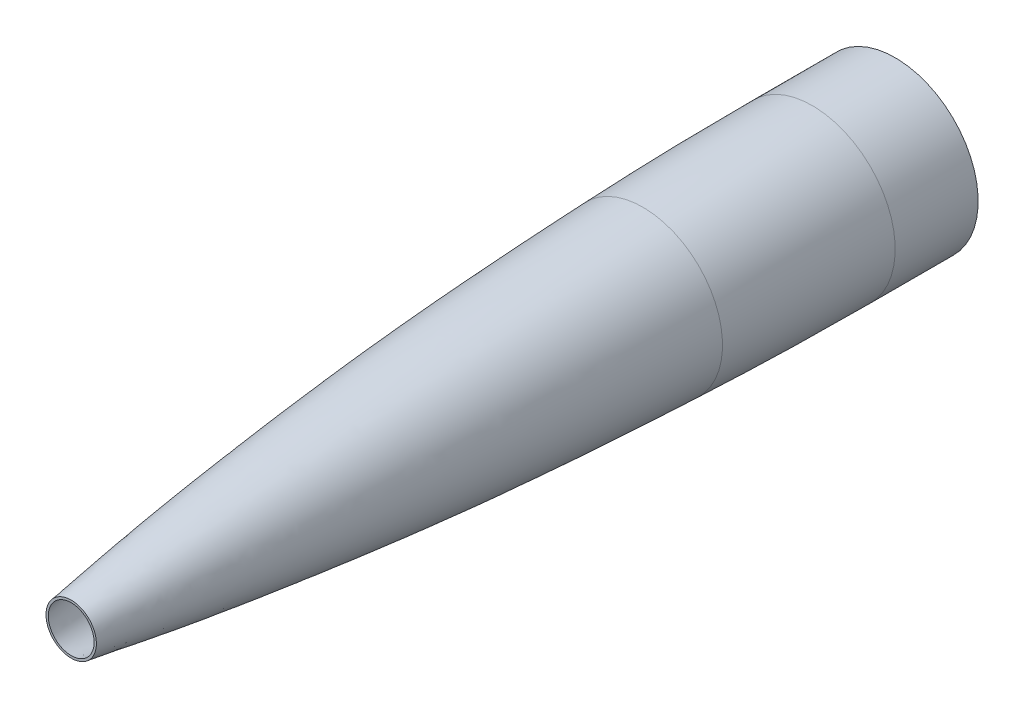
ISO-10303-21;
HEADER;
FILE_DESCRIPTION(('STEP AP214'),'2;1');
FILE_NAME('part.step','',(''),(''),'','','');
FILE_SCHEMA(('AUTOMOTIVE_DESIGN { 1 0 10303 214 1 1 1 1 }'));
ENDSEC;
DATA;
#1=APPLICATION_CONTEXT('core data for automotive mechanical design processes');
#2=APPLICATION_PROTOCOL_DEFINITION('international standard','automotive_design',2000,#1);
#3=PRODUCT_CONTEXT('',#1,'mechanical');
#4=PRODUCT('Part','Part','',(#3));
#5=PRODUCT_RELATED_PRODUCT_CATEGORY('part','',(#4));
#6=PRODUCT_DEFINITION_FORMATION('','',#4);
#7=PRODUCT_DEFINITION_CONTEXT('part definition',#1,'design');
#8=PRODUCT_DEFINITION('design','',#6,#7);
#9=PRODUCT_DEFINITION_SHAPE('','',#8);
#10=(LENGTH_UNIT() NAMED_UNIT(*) SI_UNIT(.MILLI.,.METRE.));
#11=(NAMED_UNIT(*) PLANE_ANGLE_UNIT() SI_UNIT($,.RADIAN.));
#12=(NAMED_UNIT(*) SI_UNIT($,.STERADIAN.) SOLID_ANGLE_UNIT());
#13=UNCERTAINTY_MEASURE_WITH_UNIT(LENGTH_MEASURE(1.E-05),#10,'distance_accuracy_value','');
#14=(GEOMETRIC_REPRESENTATION_CONTEXT(3) GLOBAL_UNCERTAINTY_ASSIGNED_CONTEXT((#13)) GLOBAL_UNIT_ASSIGNED_CONTEXT((#10,
#11,#12)) REPRESENTATION_CONTEXT('',''));
#15=CARTESIAN_POINT('',(0.,0.,0.));
#16=DIRECTION('',(0.,0.,1.));
#17=DIRECTION('',(1.,0.,0.));
#18=AXIS2_PLACEMENT_3D('',#15,#16,#17);
#19=CARTESIAN_POINT('',(0.,0.,0.));
#20=DIRECTION('',(0.,0.,1.));
#21=DIRECTION('',(1.,0.,0.));
#22=AXIS2_PLACEMENT_3D('',#19,#20,#21);
#23=PLANE('',#22);
#24=CARTESIAN_POINT('',(0.,0.,0.));
#25=DIRECTION('',(0.,0.,-1.));
#26=DIRECTION('',(-1.,0.,0.));
#27=AXIS2_PLACEMENT_3D('',#24,#25,#26);
#28=CIRCLE('',#27,21.9492765941224);
#29=CARTESIAN_POINT('',(-21.9492765941224,0.,0.));
#30=VERTEX_POINT('',#29);
#31=EDGE_CURVE('E46',#30,#30,#28,.T.);
#32=ORIENTED_EDGE('',*,*,#31,.T.);
#33=EDGE_LOOP('',(#32));
#34=FACE_BOUND('',#33,.T.);
#35=CARTESIAN_POINT('',(0.,0.,0.));
#36=DIRECTION('',(0.,0.,-1.));
#37=DIRECTION('',(-1.,0.,0.));
#38=AXIS2_PLACEMENT_3D('',#35,#36,#37);
#39=CIRCLE('',#38,24.1300000004652);
#40=CARTESIAN_POINT('',(-24.1300000004652,0.,0.));
#41=VERTEX_POINT('',#40);
#42=EDGE_CURVE('E10',#41,#41,#39,.T.);
#43=ORIENTED_EDGE('',*,*,#42,.F.);
#44=EDGE_LOOP('',(#43));
#45=FACE_BOUND('',#44,.T.);
#46=ADVANCED_FACE('F36',(#34,#45),#23,.T.);
#47=CARTESIAN_POINT('',(23.6093000006736,0.,3.66138359766256));
#48=CARTESIAN_POINT('',(23.713440000663,0.,2.92910687791197));
#49=CARTESIAN_POINT('',(23.8175800006523,0.,2.19683015816137));
#50=CARTESIAN_POINT('',(23.9217200006416,0.,1.46455343841078));
#51=CARTESIAN_POINT('',(24.0258600006309,0.,0.73227671866018));
#52=CARTESIAN_POINT('',(24.1300000006202,0.,-1.09041595197645E-09));
#53=CARTESIAN_POINT('',(34.5439999995525,0.,-73.22767197615));
#54=CARTESIAN_POINT('',(44.9579999977144,0.,-112.391094168987));
#55=CARTESIAN_POINT('',(55.3719999985113,0.,-268.074012876022));
#56=CARTESIAN_POINT('',(65.7859999960907,0.,-281.481829661402));
#57=CARTESIAN_POINT('',(76.1999999993788,0.,-547.325214573675));
#58=B_SPLINE_CURVE_WITH_KNOTS('',5,(#47,#48,#49,#50,#51,#52,#53,#54,#55,#56,#57),.UNSPECIFIED.,
.F.,.F.,(6,5,6),(0.0790522202796356,0.0878358002843633,0.966193800757135),.UNSPECIFIED.);
#59=CARTESIAN_POINT('',(1.74175377047759E-12,0.,-788.90114));
#60=DIRECTION('',(0.,0.,-1.));
#61=AXIS1_PLACEMENT('',#59,#60);
#62=SURFACE_OF_REVOLUTION('',#58,#61);
#63=CARTESIAN_POINT('',(1.20839698135311E-12,0.,-547.325214574175));
#64=DIRECTION('',(0.,0.,-1.));
#65=DIRECTION('',(-1.,0.,0.));
#66=AXIS2_PLACEMENT_3D('',#63,#64,#65);
#67=CIRCLE('',#66,76.1999999994162);
#68=CARTESIAN_POINT('',(-76.199999999415,0.,-547.325214574175));
#69=VERTEX_POINT('',#68);
#70=EDGE_CURVE('E42',#69,#69,#67,.T.);
#71=ORIENTED_EDGE('',*,*,#70,.F.);
#72=EDGE_LOOP('',(#71));
#73=FACE_BOUND('',#72,.T.);
#74=ORIENTED_EDGE('',*,*,#42,.T.);
#75=EDGE_LOOP('',(#74));
#76=FACE_BOUND('',#75,.T.);
#77=ADVANCED_FACE('F62',(#73,#76),#62,.T.);
#78=CARTESIAN_POINT('',(1.11774806950198E-12,0.,-788.90114));
#79=DIRECTION('',(0.,0.,1.));
#80=DIRECTION('',(1.,0.,0.));
#81=AXIS2_PLACEMENT_3D('',#78,#79,#80);
#82=PLANE('',#81);
#83=CARTESIAN_POINT('',(1.74175377047759E-12,0.,-788.90114));
#84=DIRECTION('',(0.,0.,1.));
#85=DIRECTION('',(1.,0.,0.));
#86=AXIS2_PLACEMENT_3D('',#83,#84,#85);
#87=CIRCLE('',#86,76.1999999999983);
#88=CARTESIAN_POINT('',(76.2000000000001,0.,-788.90114));
#89=VERTEX_POINT('',#88);
#90=EDGE_CURVE('E57',#89,#89,#87,.F.);
#91=ORIENTED_EDGE('',*,*,#90,.F.);
#92=EDGE_LOOP('',(#91));
#93=FACE_BOUND('',#92,.T.);
#94=CARTESIAN_POINT('',(1.74175377047759E-12,0.,-788.90114));
#95=DIRECTION('',(0.,0.,-1.));
#96=DIRECTION('',(-1.,0.,0.));
#97=AXIS2_PLACEMENT_3D('',#94,#95,#96);
#98=CIRCLE('',#97,79.374999999998);
#99=CARTESIAN_POINT('',(-79.3749999999962,0.,-788.90114));
#100=VERTEX_POINT('',#99);
#101=EDGE_CURVE('E146',#100,#100,#98,.T.);
#102=ORIENTED_EDGE('',*,*,#101,.T.);
#103=EDGE_LOOP('',(#102));
#104=FACE_BOUND('',#103,.T.);
#105=ADVANCED_FACE('F67',(#93,#104),#82,.F.);
#106=CARTESIAN_POINT('',(23.6093000006736,0.,3.66138359766256));
#107=CARTESIAN_POINT('',(23.713440000663,0.,2.92910687791197));
#108=CARTESIAN_POINT('',(23.8175800006523,0.,2.19683015816137));
#109=CARTESIAN_POINT('',(23.9217200006416,0.,1.46455343841078));
#110=CARTESIAN_POINT('',(24.0258600006309,0.,0.73227671866018));
#111=CARTESIAN_POINT('',(34.5439999995525,0.,-73.22767197615));
#112=CARTESIAN_POINT('',(44.9579999977144,0.,-112.391094168987));
#113=CARTESIAN_POINT('',(55.3719999985113,0.,-268.074012876022));
#114=CARTESIAN_POINT('',(65.7859999960907,0.,-281.481829661402));
#115=CARTESIAN_POINT('',(76.1999999993788,0.,-547.325214573675));
#116=B_SPLINE_CURVE_WITH_KNOTS('',5,(#106,#107,#108,#109,#110,#111,#112,#113,#114,#115),
.UNSPECIFIED.,.F.,.F.,(6,4,6),(0.0790522202796356,0.0878358002843633,0.966193800757135),.UNSPECIFIED.);
#117=CARTESIAN_POINT('',(1.74175377047759E-12,0.,-788.90114));
#118=DIRECTION('',(0.,0.,-1.));
#119=AXIS1_PLACEMENT('',#117,#118);
#120=SURFACE_OF_REVOLUTION('',#116,#119);
#121=OFFSET_SURFACE('',#120,-2.159,.F.);
#122=CARTESIAN_POINT('',(1.08899757895277E-12,0.,-547.409725213669));
#123=DIRECTION('',(0.,0.,-1.));
#124=DIRECTION('',(-1.,0.,0.));
#125=AXIS2_PLACEMENT_3D('',#122,#123,#124);
#126=CIRCLE('',#125,74.0426546511213);
#127=CARTESIAN_POINT('',(-74.0426546511202,0.,-547.409725213669));
#128=VERTEX_POINT('',#127);
#129=EDGE_CURVE('E50',#128,#128,#126,.T.);
#130=ORIENTED_EDGE('',*,*,#129,.T.);
#131=EDGE_LOOP('',(#130));
#132=FACE_BOUND('',#131,.T.);
#133=ORIENTED_EDGE('',*,*,#31,.F.);
#134=EDGE_LOOP('',(#133));
#135=FACE_BOUND('',#134,.T.);
#136=ADVANCED_FACE('F69',(#132,#135),#121,.F.);
#137=CARTESIAN_POINT('',(1.33226762955019E-12,0.,-657.595231051004));
#138=DIRECTION('',(0.,0.,-1.));
#139=DIRECTION('',(-1.,0.,0.));
#140=AXIS2_PLACEMENT_3D('',#137,#138,#139);
#141=DEGENERATE_TOROIDAL_SURFACE('',#140,2738.71784379868,2814.91784379868,.F.);
#142=CARTESIAN_POINT('',(1.45185361645082E-12,0.,-657.595231051011));
#143=DIRECTION('',(0.,0.,-1.));
#144=DIRECTION('',(-1.,0.,0.));
#145=AXIS2_PLACEMENT_3D('',#142,#143,#144);
#146=CIRCLE('',#145,76.1999999999983);
#147=CARTESIAN_POINT('',(-76.1999999999969,0.,-657.595231051011));
#148=VERTEX_POINT('',#147);
#149=EDGE_CURVE('E152',#148,#148,#146,.T.);
#150=ORIENTED_EDGE('',*,*,#149,.T.);
#151=EDGE_LOOP('',(#150));
#152=FACE_BOUND('',#151,.T.);
#153=ORIENTED_EDGE('',*,*,#129,.F.);
#154=EDGE_LOOP('',(#153));
#155=FACE_BOUND('',#154,.T.);
#156=ADVANCED_FACE('F71',(#152,#155),#141,.T.);
#157=CARTESIAN_POINT('',(1.74175377047759E-12,0.,-788.90114));
#158=DIRECTION('',(0.,0.,-1.));
#159=DIRECTION('',(-1.,0.,0.));
#160=AXIS2_PLACEMENT_3D('',#157,#158,#159);
#161=CYLINDRICAL_SURFACE('',#160,76.1999999999983);
#162=ORIENTED_EDGE('',*,*,#90,.T.);
#163=EDGE_LOOP('',(#162));
#164=FACE_BOUND('',#163,.T.);
#165=ORIENTED_EDGE('',*,*,#149,.F.);
#166=EDGE_LOOP('',(#165));
#167=FACE_BOUND('',#166,.T.);
#168=ADVANCED_FACE('F74',(#164,#167),#161,.F.);
#169=CARTESIAN_POINT('',(1.77635683940025E-12,0.,-709.48700349673));
#170=DIRECTION('',(0.,0.,-1.));
#171=DIRECTION('',(-1.,0.,0.));
#172=AXIS2_PLACEMENT_3D('',#169,#170,#171);
#173=DEGENERATE_TOROIDAL_SURFACE('',#172,4063.38506402266,4142.76006402266,.F.);
#174=CARTESIAN_POINT('',(1.56642144470129E-12,0.,-709.48700349674));
#175=DIRECTION('',(0.,0.,-1.));
#176=DIRECTION('',(-1.,0.,0.));
#177=AXIS2_PLACEMENT_3D('',#174,#175,#176);
#178=CIRCLE('',#177,79.3749999999982);
#179=CARTESIAN_POINT('',(-79.3749999999966,0.,-709.48700349674));
#180=VERTEX_POINT('',#179);
#181=EDGE_CURVE('E149',#180,#180,#178,.T.);
#182=ORIENTED_EDGE('',*,*,#181,.F.);
#183=EDGE_LOOP('',(#182));
#184=FACE_BOUND('',#183,.T.);
#185=ORIENTED_EDGE('',*,*,#70,.T.);
#186=EDGE_LOOP('',(#185));
#187=FACE_BOUND('',#186,.T.);
#188=ADVANCED_FACE('F77',(#184,#187),#173,.F.);
#189=CARTESIAN_POINT('',(1.74175377047759E-12,0.,-788.90114));
#190=DIRECTION('',(0.,0.,-1.));
#191=DIRECTION('',(-1.,0.,0.));
#192=AXIS2_PLACEMENT_3D('',#189,#190,#191);
#193=CYLINDRICAL_SURFACE('',#192,79.3749999999981);
#194=ORIENTED_EDGE('',*,*,#101,.F.);
#195=EDGE_LOOP('',(#194));
#196=FACE_BOUND('',#195,.T.);
#197=ORIENTED_EDGE('',*,*,#181,.T.);
#198=EDGE_LOOP('',(#197));
#199=FACE_BOUND('',#198,.T.);
#200=ADVANCED_FACE('F130',(#196,#199),#193,.T.);
#201=CLOSED_SHELL('',(#46,#77,#105,#136,#156,#168,#188,#200));
#202=MANIFOLD_SOLID_BREP('B2',#201);
#203=ADVANCED_BREP_SHAPE_REPRESENTATION('',(#18,#202),#14);
#204=SHAPE_DEFINITION_REPRESENTATION(#9,#203);
ENDSEC;
END-ISO-10303-21;
